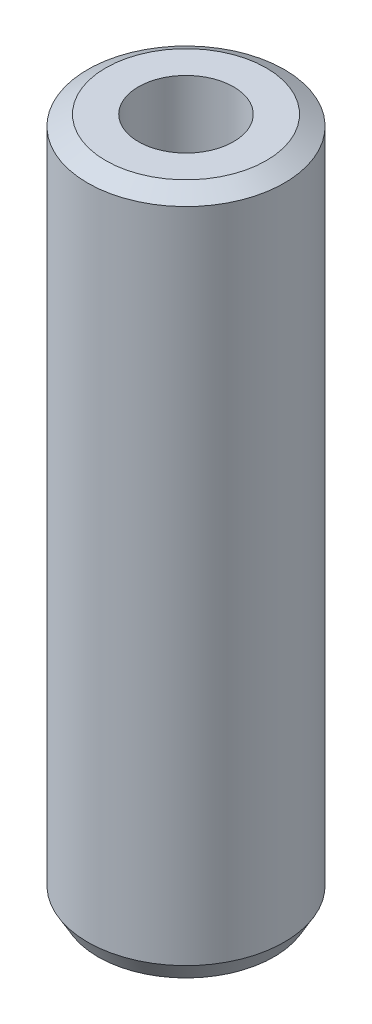
ISO-10303-21;
HEADER;
FILE_DESCRIPTION(('STEP AP214'),'2;1');
FILE_NAME('part.step','',(''),(''),'','','');
FILE_SCHEMA(('AUTOMOTIVE_DESIGN { 1 0 10303 214 1 1 1 1 }'));
ENDSEC;
DATA;
#1=APPLICATION_CONTEXT('core data for automotive mechanical design processes');
#2=APPLICATION_PROTOCOL_DEFINITION('international standard','automotive_design',2000,#1);
#3=PRODUCT_CONTEXT('',#1,'mechanical');
#4=PRODUCT('Part','Part','',(#3));
#5=PRODUCT_RELATED_PRODUCT_CATEGORY('part','',(#4));
#6=PRODUCT_DEFINITION_FORMATION('','',#4);
#7=PRODUCT_DEFINITION_CONTEXT('part definition',#1,'design');
#8=PRODUCT_DEFINITION('design','',#6,#7);
#9=PRODUCT_DEFINITION_SHAPE('','',#8);
#10=(LENGTH_UNIT() NAMED_UNIT(*) SI_UNIT(.MILLI.,.METRE.));
#11=(NAMED_UNIT(*) PLANE_ANGLE_UNIT() SI_UNIT($,.RADIAN.));
#12=(NAMED_UNIT(*) SI_UNIT($,.STERADIAN.) SOLID_ANGLE_UNIT());
#13=UNCERTAINTY_MEASURE_WITH_UNIT(LENGTH_MEASURE(1.E-05),#10,'distance_accuracy_value','');
#14=(GEOMETRIC_REPRESENTATION_CONTEXT(3) GLOBAL_UNCERTAINTY_ASSIGNED_CONTEXT((#13)) GLOBAL_UNIT_ASSIGNED_CONTEXT((#10,
#11,#12)) REPRESENTATION_CONTEXT('',''));
#15=CARTESIAN_POINT('',(0.,0.,0.));
#16=DIRECTION('',(0.,0.,1.));
#17=DIRECTION('',(1.,0.,0.));
#18=AXIS2_PLACEMENT_3D('',#15,#16,#17);
#19=CARTESIAN_POINT('',(0.,244.042978866937,0.));
#20=DIRECTION('',(0.,-1.,0.));
#21=DIRECTION('',(0.,0.,-1.));
#22=AXIS2_PLACEMENT_3D('',#19,#20,#21);
#23=CYLINDRICAL_SURFACE('',#22,35.);
#24=CARTESIAN_POINT('',(0.,240.336453974464,0.));
#25=DIRECTION('',(0.,1.,0.));
#26=DIRECTION('',(0.,0.,1.));
#27=AXIS2_PLACEMENT_3D('',#24,#25,#26);
#28=CIRCLE('',#27,35.);
#29=CARTESIAN_POINT('',(0.,240.336453974464,-35.));
#30=VERTEX_POINT('',#29);
#31=EDGE_CURVE('E50',#30,#30,#28,.F.);
#32=CARTESIAN_POINT('',(0.,6.41988943328134,0.));
#33=DIRECTION('',(0.,1.,0.));
#34=DIRECTION('',(0.,0.,1.));
#35=AXIS2_PLACEMENT_3D('',#32,#33,#34);
#36=CIRCLE('',#35,35.);
#37=CARTESIAN_POINT('',(0.,6.41988943328131,-35.));
#38=VERTEX_POINT('',#37);
#39=EDGE_CURVE('E51',#38,#38,#36,.T.);
#40=CARTESIAN_POINT('',(0.,240.336453974464,-35.));
#41=CARTESIAN_POINT('',(0.,237.899823093827,-35.));
#42=CARTESIAN_POINT('',(0.,235.463192213189,-35.));
#43=CARTESIAN_POINT('',(0.,230.589930451915,-35.));
#44=CARTESIAN_POINT('',(0.,228.153299571277,-35.));
#45=CARTESIAN_POINT('',(0.,223.280037810003,-35.));
#46=CARTESIAN_POINT('',(0.,220.843406929365,-35.));
#47=CARTESIAN_POINT('',(0.,215.970145168091,-35.));
#48=CARTESIAN_POINT('',(0.,213.533514287454,-35.));
#49=CARTESIAN_POINT('',(0.,208.660252526179,-35.));
#50=CARTESIAN_POINT('',(0.,206.223621645542,-35.));
#51=CARTESIAN_POINT('',(0.,201.350359884267,-35.));
#52=CARTESIAN_POINT('',(0.,198.91372900363,-35.));
#53=CARTESIAN_POINT('',(0.,194.040467242355,-35.));
#54=CARTESIAN_POINT('',(0.,191.603836361718,-35.));
#55=CARTESIAN_POINT('',(0.,186.730574600443,-35.));
#56=CARTESIAN_POINT('',(0.,184.293943719806,-35.));
#57=CARTESIAN_POINT('',(0.,179.420681958531,-35.));
#58=CARTESIAN_POINT('',(0.,176.984051077894,-35.));
#59=CARTESIAN_POINT('',(0.,172.110789316619,-35.));
#60=CARTESIAN_POINT('',(0.,169.674158435982,-35.));
#61=CARTESIAN_POINT('',(0.,164.800896674707,-35.));
#62=CARTESIAN_POINT('',(0.,162.36426579407,-35.));
#63=CARTESIAN_POINT('',(0.,157.491004032795,-35.));
#64=CARTESIAN_POINT('',(0.,155.054373152158,-35.));
#65=CARTESIAN_POINT('',(0.,150.181111390883,-35.));
#66=CARTESIAN_POINT('',(0.,147.744480510246,-35.));
#67=CARTESIAN_POINT('',(0.,142.871218748971,-35.));
#68=CARTESIAN_POINT('',(0.,140.434587868334,-35.));
#69=CARTESIAN_POINT('',(0.,135.561326107059,-35.));
#70=CARTESIAN_POINT('',(0.,133.124695226422,-35.));
#71=CARTESIAN_POINT('',(0.,128.251433465147,-35.));
#72=CARTESIAN_POINT('',(0.,125.81480258451,-35.));
#73=CARTESIAN_POINT('',(0.,120.941540823235,-35.));
#74=CARTESIAN_POINT('',(0.,118.504909942598,-35.));
#75=CARTESIAN_POINT('',(0.,113.631648181323,-35.));
#76=CARTESIAN_POINT('',(0.,111.195017300686,-35.));
#77=CARTESIAN_POINT('',(0.,106.321755539411,-35.));
#78=CARTESIAN_POINT('',(0.,103.885124658774,-35.));
#79=CARTESIAN_POINT('',(0.,99.0118628974995,-35.));
#80=CARTESIAN_POINT('',(0.,96.5752320168622,-35.));
#81=CARTESIAN_POINT('',(0.,91.7019702555875,-35.));
#82=CARTESIAN_POINT('',(0.,89.2653393749502,-35.));
#83=CARTESIAN_POINT('',(0.,84.3920776136756,-35.));
#84=CARTESIAN_POINT('',(0.,81.9554467330382,-35.));
#85=CARTESIAN_POINT('',(0.,77.0821849717636,-35.));
#86=CARTESIAN_POINT('',(0.,74.6455540911263,-35.));
#87=CARTESIAN_POINT('',(0.,69.7722923298517,-35.));
#88=CARTESIAN_POINT('',(0.,67.3356614492143,-35.));
#89=CARTESIAN_POINT('',(0.,62.4623996879397,-35.));
#90=CARTESIAN_POINT('',(0.,60.0257688073023,-35.));
#91=CARTESIAN_POINT('',(0.,55.1525070460277,-35.));
#92=CARTESIAN_POINT('',(0.,52.7158761653904,-35.));
#93=CARTESIAN_POINT('',(0.,47.8426144041158,-35.));
#94=CARTESIAN_POINT('',(0.,45.4059835234784,-35.));
#95=CARTESIAN_POINT('',(0.,40.5327217622038,-35.));
#96=CARTESIAN_POINT('',(0.,38.0960908815665,-35.));
#97=CARTESIAN_POINT('',(0.,33.2228291202918,-35.));
#98=CARTESIAN_POINT('',(0.,30.7861982396545,-35.));
#99=CARTESIAN_POINT('',(0.,25.9129364783799,-35.));
#100=CARTESIAN_POINT('',(0.,23.4763055977426,-35.));
#101=CARTESIAN_POINT('',(0.,18.6030438364679,-35.));
#102=CARTESIAN_POINT('',(0.,16.1664129558306,-35.));
#103=CARTESIAN_POINT('',(0.,11.2931511945559,-35.));
#104=CARTESIAN_POINT('',(0.,8.85652031391863,-35.));
#105=CARTESIAN_POINT('',(0.,6.41988943328131,-35.));
#106=B_SPLINE_CURVE_WITH_KNOTS('',3,(#40,#41,#42,#43,#44,#45,#46,#47,#48,#49,#50,#51,#52,#53,
#54,#55,#56,#57,#58,#59,#60,#61,#62,#63,#64,#65,#66,#67,#68,#69,#70,#71,#72,#73,#74,#75,#76,#77,
#78,#79,#80,#81,#82,#83,#84,#85,#86,#87,#88,#89,#90,#91,#92,#93,#94,#95,#96,#97,#98,#99,#100,
#101,#102,#103,#104,#105),.UNSPECIFIED.,.F.,.F.,(4,2,2,2,2,2,2,2,2,2,2,2,2,2,2,2,2,2,2,2,2,2,2,
2,2,2,2,2,2,2,2,2,4),(0.,7.30989264191195,14.6197852838239,21.9296779257359,29.2395705676478,
36.5494632095598,43.8593558514717,51.1692484933837,58.4791411352957,65.7890337772076,
73.0989264191196,80.4088190610316,87.7187117029435,95.0286043448555,102.338496986767,
109.648389628679,116.958282270591,124.268174912503,131.578067554415,138.887960196327,
146.197852838239,153.507745480151,160.817638122063,168.127530763975,175.437423405887,
182.747316047799,190.057208689711,197.367101331623,204.676993973535,211.986886615447,
219.296779257359,226.606671899271,233.916564541183),.UNSPECIFIED.);
#107=EDGE_CURVE('BSEAM39',#30,#38,#106,.T.);
#108=ORIENTED_EDGE('',*,*,#31,.T.);
#109=ORIENTED_EDGE('',*,*,#39,.T.);
#110=ORIENTED_EDGE('',*,*,#107,.T.);
#111=ORIENTED_EDGE('',*,*,#107,.F.);
#112=EDGE_LOOP('',(#108,#110,#109,#111));
#113=FACE_BOUND('',#112,.T.);
#114=ADVANCED_FACE('F39',(#113),#23,.T.);
#115=CARTESIAN_POINT('',(0.,244.042978866937,0.));
#116=DIRECTION('',(0.,1.,0.));
#117=DIRECTION('',(0.,0.,1.));
#118=AXIS2_PLACEMENT_3D('',#115,#116,#117);
#119=PLANE('',#118);
#120=CARTESIAN_POINT('',(0.,244.042978866937,0.));
#121=DIRECTION('',(0.,1.,0.));
#122=DIRECTION('',(0.,0.,1.));
#123=AXIS2_PLACEMENT_3D('',#120,#121,#122);
#124=CIRCLE('',#123,28.5801105667191);
#125=CARTESIAN_POINT('',(0.,244.042978866937,28.5801105667191));
#126=VERTEX_POINT('',#125);
#127=EDGE_CURVE('E54',#126,#126,#124,.T.);
#128=ORIENTED_EDGE('',*,*,#127,.T.);
#129=EDGE_LOOP('',(#128));
#130=FACE_BOUND('',#129,.T.);
#131=CARTESIAN_POINT('',(0.,244.042978866937,0.));
#132=DIRECTION('',(0.,1.,0.));
#133=DIRECTION('',(0.,0.,1.));
#134=AXIS2_PLACEMENT_3D('',#131,#132,#133);
#135=CIRCLE('',#134,16.9350831647938);
#136=CARTESIAN_POINT('',(0.,244.042978866937,-16.9350831647938));
#137=VERTEX_POINT('',#136);
#138=EDGE_CURVE('E58',#137,#137,#135,.T.);
#139=ORIENTED_EDGE('',*,*,#138,.F.);
#140=EDGE_LOOP('',(#139));
#141=FACE_BOUND('',#140,.T.);
#142=ADVANCED_FACE('F69',(#130,#141),#119,.T.);
#143=CARTESIAN_POINT('',(0.,0.,0.));
#144=DIRECTION('',(0.,1.,0.));
#145=DIRECTION('',(0.,0.,1.));
#146=AXIS2_PLACEMENT_3D('',#143,#144,#145);
#147=PLANE('',#146);
#148=CARTESIAN_POINT('',(0.,0.,0.));
#149=DIRECTION('',(0.,1.,0.));
#150=DIRECTION('',(0.,0.,1.));
#151=AXIS2_PLACEMENT_3D('',#148,#149,#150);
#152=CIRCLE('',#151,31.2934751075274);
#153=CARTESIAN_POINT('',(0.,0.,31.2934751075274));
#154=VERTEX_POINT('',#153);
#155=EDGE_CURVE('E10',#154,#154,#152,.F.);
#156=ORIENTED_EDGE('',*,*,#155,.T.);
#157=EDGE_LOOP('',(#156));
#158=FACE_BOUND('',#157,.T.);
#159=CARTESIAN_POINT('',(0.,0.,0.));
#160=DIRECTION('',(0.,1.,0.));
#161=DIRECTION('',(0.,0.,1.));
#162=AXIS2_PLACEMENT_3D('',#159,#160,#161);
#163=CIRCLE('',#162,16.9350831647938);
#164=CARTESIAN_POINT('',(0.,0.,-16.9350831647938));
#165=VERTEX_POINT('',#164);
#166=EDGE_CURVE('E63',#165,#165,#163,.T.);
#167=ORIENTED_EDGE('',*,*,#166,.T.);
#168=EDGE_LOOP('',(#167));
#169=FACE_BOUND('',#168,.T.);
#170=ADVANCED_FACE('F75',(#158,#169),#147,.F.);
#171=CARTESIAN_POINT('',(0.,244.042978866937,0.));
#172=DIRECTION('',(0.,-1.,0.));
#173=DIRECTION('',(0.,0.,-1.));
#174=AXIS2_PLACEMENT_3D('',#171,#172,#173);
#175=CYLINDRICAL_SURFACE('',#174,16.9350831647938);
#176=CARTESIAN_POINT('',(0.,244.042978866937,-16.9350831647938));
#177=CARTESIAN_POINT('',(0.,241.500864503739,-16.9350831647938));
#178=CARTESIAN_POINT('',(0.,238.958750140542,-16.9350831647938));
#179=CARTESIAN_POINT('',(0.,233.874521414147,-16.9350831647938));
#180=CARTESIAN_POINT('',(0.,231.33240705095,-16.9350831647938));
#181=CARTESIAN_POINT('',(0.,226.248178324556,-16.9350831647938));
#182=CARTESIAN_POINT('',(0.,223.706063961358,-16.9350831647938));
#183=CARTESIAN_POINT('',(0.,218.621835234964,-16.9350831647938));
#184=CARTESIAN_POINT('',(0.,216.079720871767,-16.9350831647938));
#185=CARTESIAN_POINT('',(0.,210.995492145372,-16.9350831647938));
#186=CARTESIAN_POINT('',(0.,208.453377782175,-16.9350831647938));
#187=CARTESIAN_POINT('',(0.,203.36914905578,-16.9350831647938));
#188=CARTESIAN_POINT('',(0.,200.827034692583,-16.9350831647938));
#189=CARTESIAN_POINT('',(0.,195.742805966189,-16.9350831647938));
#190=CARTESIAN_POINT('',(0.,193.200691602991,-16.9350831647938));
#191=CARTESIAN_POINT('',(0.,188.116462876597,-16.9350831647938));
#192=CARTESIAN_POINT('',(0.,185.5743485134,-16.9350831647938));
#193=CARTESIAN_POINT('',(0.,180.490119787005,-16.9350831647938));
#194=CARTESIAN_POINT('',(0.,177.948005423808,-16.9350831647938));
#195=CARTESIAN_POINT('',(0.,172.863776697413,-16.9350831647938));
#196=CARTESIAN_POINT('',(0.,170.321662334216,-16.9350831647938));
#197=CARTESIAN_POINT('',(0.,165.237433607822,-16.9350831647938));
#198=CARTESIAN_POINT('',(0.,162.695319244624,-16.9350831647938));
#199=CARTESIAN_POINT('',(0.,157.61109051823,-16.9350831647938));
#200=CARTESIAN_POINT('',(0.,155.068976155033,-16.9350831647938));
#201=CARTESIAN_POINT('',(0.,149.984747428638,-16.9350831647938));
#202=CARTESIAN_POINT('',(0.,147.442633065441,-16.9350831647938));
#203=CARTESIAN_POINT('',(0.,142.358404339046,-16.9350831647938));
#204=CARTESIAN_POINT('',(0.,139.816289975849,-16.9350831647938));
#205=CARTESIAN_POINT('',(0.,134.732061249454,-16.9350831647938));
#206=CARTESIAN_POINT('',(0.,132.189946886257,-16.9350831647938));
#207=CARTESIAN_POINT('',(0.,127.105718159863,-16.9350831647938));
#208=CARTESIAN_POINT('',(0.,124.563603796665,-16.9350831647938));
#209=CARTESIAN_POINT('',(0.,119.479375070271,-16.9350831647938));
#210=CARTESIAN_POINT('',(0.,116.937260707074,-16.9350831647938));
#211=CARTESIAN_POINT('',(0.,111.853031980679,-16.9350831647938));
#212=CARTESIAN_POINT('',(0.,109.310917617482,-16.9350831647938));
#213=CARTESIAN_POINT('',(0.,104.226688891087,-16.9350831647938));
#214=CARTESIAN_POINT('',(0.,101.68457452789,-16.9350831647938));
#215=CARTESIAN_POINT('',(0.,96.6003458014957,-16.9350831647938));
#216=CARTESIAN_POINT('',(0.,94.0582314382985,-16.9350831647938));
#217=CARTESIAN_POINT('',(0.,88.9740027119039,-16.9350831647938));
#218=CARTESIAN_POINT('',(0.,86.4318883487067,-16.9350831647938));
#219=CARTESIAN_POINT('',(0.,81.3476596223122,-16.9350831647938));
#220=CARTESIAN_POINT('',(0.,78.8055452591149,-16.9350831647938));
#221=CARTESIAN_POINT('',(0.,73.7213165327204,-16.9350831647938));
#222=CARTESIAN_POINT('',(0.,71.1792021695232,-16.9350831647938));
#223=CARTESIAN_POINT('',(0.,66.0949734431287,-16.9350831647938));
#224=CARTESIAN_POINT('',(0.,63.5528590799314,-16.9350831647938));
#225=CARTESIAN_POINT('',(0.,58.4686303535369,-16.9350831647938));
#226=CARTESIAN_POINT('',(0.,55.9265159903396,-16.9350831647938));
#227=CARTESIAN_POINT('',(0.,50.8422872639451,-16.9350831647938));
#228=CARTESIAN_POINT('',(0.,48.3001729007479,-16.9350831647938));
#229=CARTESIAN_POINT('',(0.,43.2159441743534,-16.9350831647938));
#230=CARTESIAN_POINT('',(0.,40.6738298111561,-16.9350831647938));
#231=CARTESIAN_POINT('',(0.,35.5896010847616,-16.9350831647938));
#232=CARTESIAN_POINT('',(0.,33.0474867215643,-16.9350831647938));
#233=CARTESIAN_POINT('',(0.,27.9632579951698,-16.9350831647938));
#234=CARTESIAN_POINT('',(0.,25.4211436319726,-16.9350831647938));
#235=CARTESIAN_POINT('',(0.,20.3369149055781,-16.9350831647938));
#236=CARTESIAN_POINT('',(0.,17.7948005423808,-16.9350831647938));
#237=CARTESIAN_POINT('',(0.,12.7105718159863,-16.9350831647938));
#238=CARTESIAN_POINT('',(0.,10.168457452789,-16.9350831647938));
#239=CARTESIAN_POINT('',(0.,5.0842287263945,-16.9350831647938));
#240=CARTESIAN_POINT('',(0.,2.54211436319725,-16.9350831647938));
#241=CARTESIAN_POINT('',(0.,0.,-16.9350831647938));
#242=B_SPLINE_CURVE_WITH_KNOTS('',3,(#176,#177,#178,#179,#180,#181,#182,#183,#184,#185,#186,
#187,#188,#189,#190,#191,#192,#193,#194,#195,#196,#197,#198,#199,#200,#201,#202,#203,#204,#205,
#206,#207,#208,#209,#210,#211,#212,#213,#214,#215,#216,#217,#218,#219,#220,#221,#222,#223,#224,
#225,#226,#227,#228,#229,#230,#231,#232,#233,#234,#235,#236,#237,#238,#239,#240,#241),
.UNSPECIFIED.,.F.,.F.,(4,2,2,2,2,2,2,2,2,2,2,2,2,2,2,2,2,2,2,2,2,2,2,2,2,2,2,2,2,2,2,2,4),(0.,
7.62634308959179,15.2526861791835,22.8790292687753,30.5053723583671,38.1317154479588,
45.7580585375506,53.3844016271424,61.0107447167342,68.6370878063259,76.2634308959177,
83.8897739855094,91.5161170751012,99.142460164693,106.768803254285,114.395146343877,
122.021489433468,129.64783252306,137.274175612652,144.900518702244,152.526861791835,
160.153204881427,167.779547971019,175.405891060611,183.032234150202,190.658577239794,
198.284920329386,205.911263418978,213.537606508569,221.163949598161,228.790292687753,
236.416635777345,244.042978866937),.UNSPECIFIED.);
#243=EDGE_CURVE('BSEAM70',#137,#165,#242,.T.);
#244=ORIENTED_EDGE('',*,*,#138,.T.);
#245=ORIENTED_EDGE('',*,*,#166,.F.);
#246=ORIENTED_EDGE('',*,*,#243,.T.);
#247=ORIENTED_EDGE('',*,*,#243,.F.);
#248=EDGE_LOOP('',(#244,#246,#245,#247));
#249=FACE_BOUND('',#248,.T.);
#250=ADVANCED_FACE('F70',(#249),#175,.F.);
#251=CARTESIAN_POINT('',(0.,244.042978866937,0.));
#252=DIRECTION('',(0.,-1.,0.));
#253=DIRECTION('',(0.,0.,-1.));
#254=AXIS2_PLACEMENT_3D('',#251,#252,#253);
#255=CONICAL_SURFACE('',#254,28.5801105667191,1.04719755119659);
#256=ORIENTED_EDGE('',*,*,#31,.F.);
#257=EDGE_LOOP('',(#256));
#258=FACE_BOUND('',#257,.T.);
#259=ORIENTED_EDGE('',*,*,#127,.F.);
#260=EDGE_LOOP('',(#259));
#261=FACE_BOUND('',#260,.T.);
#262=ADVANCED_FACE('F81',(#258,#261),#255,.T.);
#263=CARTESIAN_POINT('',(0.,6.41988943328134,0.));
#264=DIRECTION('',(0.,1.,0.));
#265=DIRECTION('',(0.,0.,1.));
#266=AXIS2_PLACEMENT_3D('',#263,#264,#265);
#267=CONICAL_SURFACE('',#266,35.,0.523598775598303);
#268=ORIENTED_EDGE('',*,*,#155,.F.);
#269=EDGE_LOOP('',(#268));
#270=FACE_BOUND('',#269,.T.);
#271=ORIENTED_EDGE('',*,*,#39,.F.);
#272=EDGE_LOOP('',(#271));
#273=FACE_BOUND('',#272,.T.);
#274=ADVANCED_FACE('F45',(#270,#273),#267,.T.);
#275=CLOSED_SHELL('',(#114,#142,#170,#250,#262,#274));
#276=MANIFOLD_SOLID_BREP('B2',#275);
#277=ADVANCED_BREP_SHAPE_REPRESENTATION('',(#18,#276),#14);
#278=SHAPE_DEFINITION_REPRESENTATION(#9,#277);
ENDSEC;
END-ISO-10303-21;
